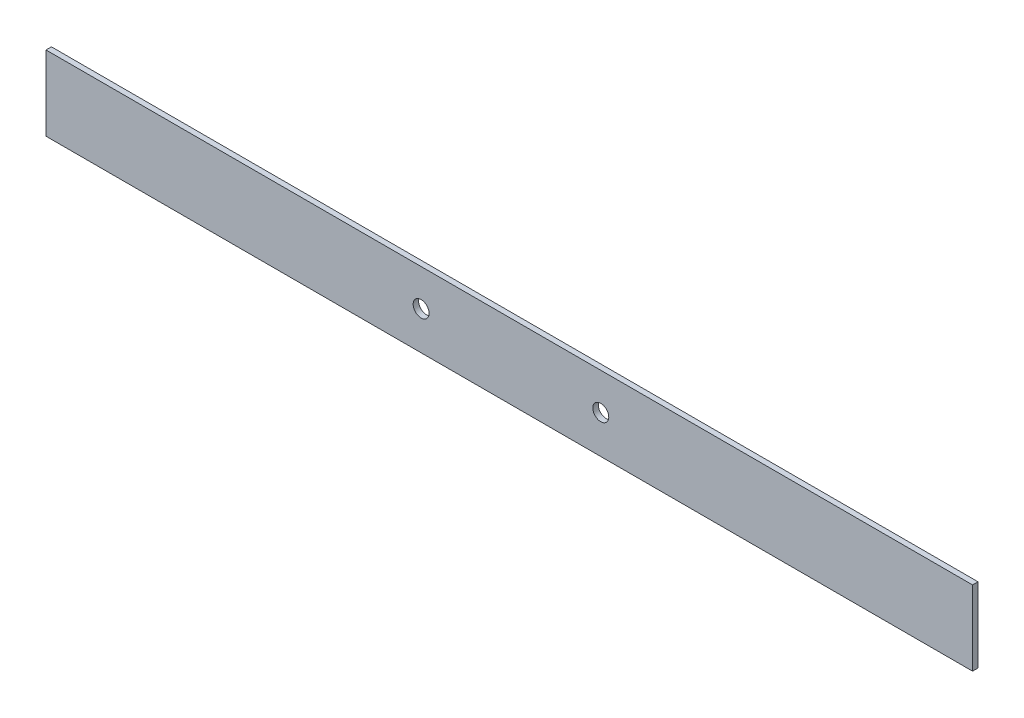
ISO-10303-21;
HEADER;
FILE_DESCRIPTION(('STEP AP214'),'2;1');
FILE_NAME('part.step','',(''),(''),'','','');
FILE_SCHEMA(('AUTOMOTIVE_DESIGN { 1 0 10303 214 1 1 1 1 }'));
ENDSEC;
DATA;
#1=APPLICATION_CONTEXT('core data for automotive mechanical design processes');
#2=APPLICATION_PROTOCOL_DEFINITION('international standard','automotive_design',2000,#1);
#3=PRODUCT_CONTEXT('',#1,'mechanical');
#4=PRODUCT('Part','Part','',(#3));
#5=PRODUCT_RELATED_PRODUCT_CATEGORY('part','',(#4));
#6=PRODUCT_DEFINITION_FORMATION('','',#4);
#7=PRODUCT_DEFINITION_CONTEXT('part definition',#1,'design');
#8=PRODUCT_DEFINITION('design','',#6,#7);
#9=PRODUCT_DEFINITION_SHAPE('','',#8);
#10=(LENGTH_UNIT() NAMED_UNIT(*) SI_UNIT(.MILLI.,.METRE.));
#11=(NAMED_UNIT(*) PLANE_ANGLE_UNIT() SI_UNIT($,.RADIAN.));
#12=(NAMED_UNIT(*) SI_UNIT($,.STERADIAN.) SOLID_ANGLE_UNIT());
#13=UNCERTAINTY_MEASURE_WITH_UNIT(LENGTH_MEASURE(1.E-05),#10,'distance_accuracy_value','');
#14=(GEOMETRIC_REPRESENTATION_CONTEXT(3) GLOBAL_UNCERTAINTY_ASSIGNED_CONTEXT((#13)) GLOBAL_UNIT_ASSIGNED_CONTEXT((#10,
#11,#12)) REPRESENTATION_CONTEXT('',''));
#15=CARTESIAN_POINT('',(0.,0.,0.));
#16=DIRECTION('',(0.,0.,1.));
#17=DIRECTION('',(1.,0.,0.));
#18=AXIS2_PLACEMENT_3D('',#15,#16,#17);
#19=CARTESIAN_POINT('',(124.,98.5,1.09144054));
#20=DIRECTION('',(0.,0.,-1.));
#21=DIRECTION('',(0.,-1.,0.));
#22=AXIS2_PLACEMENT_3D('',#19,#20,#21);
#23=PLANE('',#22);
#24=CARTESIAN_POINT('',(142.37,98.649,1.09144054));
#25=DIRECTION('',(0.,0.,1.));
#26=DIRECTION('',(1.,0.,0.));
#27=AXIS2_PLACEMENT_3D('',#24,#25,#26);
#28=CIRCLE('',#27,1.6);
#29=CARTESIAN_POINT('',(143.97,98.649,1.09144054));
#30=VERTEX_POINT('',#29);
#31=EDGE_CURVE('E20',#30,#30,#28,.T.);
#32=ORIENTED_EDGE('',*,*,#31,.F.);
#33=EDGE_LOOP('',(#32));
#34=FACE_BOUND('',#33,.T.);
#35=CARTESIAN_POINT('',(106.302,98.649,1.09144054));
#36=DIRECTION('',(0.,0.,1.));
#37=DIRECTION('',(1.,0.,0.));
#38=AXIS2_PLACEMENT_3D('',#35,#36,#37);
#39=CIRCLE('',#38,1.6);
#40=CARTESIAN_POINT('',(107.902,98.649,1.09144054));
#41=VERTEX_POINT('',#40);
#42=EDGE_CURVE('E80',#41,#41,#39,.T.);
#43=ORIENTED_EDGE('',*,*,#42,.F.);
#44=EDGE_LOOP('',(#43));
#45=FACE_BOUND('',#44,.T.);
#46=DIRECTION('',(-1.,0.,0.));
#47=VECTOR('',#46,1.);
#48=CARTESIAN_POINT('',(217.,91.,1.09144054));
#49=LINE('',#48,#47);
#50=CARTESIAN_POINT('',(217.,91.,1.09144054));
#51=VERTEX_POINT('',#50);
#52=CARTESIAN_POINT('',(31.,91.,1.09144054));
#53=VERTEX_POINT('',#52);
#54=EDGE_CURVE('E48',#51,#53,#49,.T.);
#55=ORIENTED_EDGE('',*,*,#54,.F.);
#56=DIRECTION('',(0.,-1.,0.));
#57=VECTOR('',#56,1.);
#58=CARTESIAN_POINT('',(217.,106.,1.09144054));
#59=LINE('',#58,#57);
#60=CARTESIAN_POINT('',(217.,106.,1.09144054));
#61=VERTEX_POINT('',#60);
#62=EDGE_CURVE('E114',#61,#51,#59,.T.);
#63=ORIENTED_EDGE('',*,*,#62,.F.);
#64=DIRECTION('',(1.,0.,0.));
#65=VECTOR('',#64,1.);
#66=CARTESIAN_POINT('',(31.,106.,1.09144054));
#67=LINE('',#66,#65);
#68=CARTESIAN_POINT('',(31.,106.,1.09144054));
#69=VERTEX_POINT('',#68);
#70=EDGE_CURVE('E90',#69,#61,#67,.T.);
#71=ORIENTED_EDGE('',*,*,#70,.F.);
#72=DIRECTION('',(0.,1.,0.));
#73=VECTOR('',#72,1.);
#74=CARTESIAN_POINT('',(31.,91.,1.09144054));
#75=LINE('',#74,#73);
#76=EDGE_CURVE('E94',#53,#69,#75,.T.);
#77=ORIENTED_EDGE('',*,*,#76,.F.);
#78=EDGE_LOOP('',(#55,#63,#71,#77));
#79=FACE_BOUND('',#78,.T.);
#80=ADVANCED_FACE('F17',(#34,#45,#79),#23,.F.);
#81=CARTESIAN_POINT('',(124.,98.5,0.));
#82=DIRECTION('',(0.,0.,-1.));
#83=DIRECTION('',(0.,-1.,0.));
#84=AXIS2_PLACEMENT_3D('',#81,#82,#83);
#85=PLANE('',#84);
#86=CARTESIAN_POINT('',(142.37,98.649,0.));
#87=DIRECTION('',(0.,0.,1.));
#88=DIRECTION('',(1.,0.,0.));
#89=AXIS2_PLACEMENT_3D('',#86,#87,#88);
#90=CIRCLE('',#89,1.6);
#91=CARTESIAN_POINT('',(143.97,98.649,0.));
#92=VERTEX_POINT('',#91);
#93=EDGE_CURVE('E11',#92,#92,#90,.T.);
#94=ORIENTED_EDGE('',*,*,#93,.T.);
#95=EDGE_LOOP('',(#94));
#96=FACE_BOUND('',#95,.T.);
#97=CARTESIAN_POINT('',(106.302,98.649,0.));
#98=DIRECTION('',(0.,0.,1.));
#99=DIRECTION('',(1.,0.,0.));
#100=AXIS2_PLACEMENT_3D('',#97,#98,#99);
#101=CIRCLE('',#100,1.6);
#102=CARTESIAN_POINT('',(107.902,98.649,0.));
#103=VERTEX_POINT('',#102);
#104=EDGE_CURVE('E125',#103,#103,#101,.T.);
#105=ORIENTED_EDGE('',*,*,#104,.T.);
#106=EDGE_LOOP('',(#105));
#107=FACE_BOUND('',#106,.T.);
#108=DIRECTION('',(0.,1.,0.));
#109=VECTOR('',#108,1.);
#110=CARTESIAN_POINT('',(31.,91.,0.));
#111=LINE('',#110,#109);
#112=CARTESIAN_POINT('',(31.,91.,0.));
#113=VERTEX_POINT('',#112);
#114=CARTESIAN_POINT('',(31.,106.,0.));
#115=VERTEX_POINT('',#114);
#116=EDGE_CURVE('E75',#113,#115,#111,.T.);
#117=ORIENTED_EDGE('',*,*,#116,.T.);
#118=DIRECTION('',(1.,0.,0.));
#119=VECTOR('',#118,1.);
#120=CARTESIAN_POINT('',(31.,106.,0.));
#121=LINE('',#120,#119);
#122=CARTESIAN_POINT('',(217.,106.,0.));
#123=VERTEX_POINT('',#122);
#124=EDGE_CURVE('E108',#115,#123,#121,.T.);
#125=ORIENTED_EDGE('',*,*,#124,.T.);
#126=DIRECTION('',(0.,-1.,0.));
#127=VECTOR('',#126,1.);
#128=CARTESIAN_POINT('',(217.,106.,0.));
#129=LINE('',#128,#127);
#130=CARTESIAN_POINT('',(217.,91.,0.));
#131=VERTEX_POINT('',#130);
#132=EDGE_CURVE('E77',#123,#131,#129,.T.);
#133=ORIENTED_EDGE('',*,*,#132,.T.);
#134=DIRECTION('',(-1.,0.,0.));
#135=VECTOR('',#134,1.);
#136=CARTESIAN_POINT('',(217.,91.,0.));
#137=LINE('',#136,#135);
#138=EDGE_CURVE('E38',#131,#113,#137,.T.);
#139=ORIENTED_EDGE('',*,*,#138,.T.);
#140=EDGE_LOOP('',(#117,#125,#133,#139));
#141=FACE_BOUND('',#140,.T.);
#142=ADVANCED_FACE('F73',(#96,#107,#141),#85,.T.);
#143=CARTESIAN_POINT('',(142.37,98.649,0.));
#144=DIRECTION('',(0.,0.,-1.));
#145=DIRECTION('',(1.,0.,0.));
#146=AXIS2_PLACEMENT_3D('',#143,#144,#145);
#147=CYLINDRICAL_SURFACE('',#146,1.6);
#148=ORIENTED_EDGE('',*,*,#31,.T.);
#149=EDGE_LOOP('',(#148));
#150=FACE_BOUND('',#149,.T.);
#151=ORIENTED_EDGE('',*,*,#93,.F.);
#152=EDGE_LOOP('',(#151));
#153=FACE_BOUND('',#152,.T.);
#154=ADVANCED_FACE('F143',(#150,#153),#147,.F.);
#155=CARTESIAN_POINT('',(106.302,98.649,0.));
#156=DIRECTION('',(0.,0.,-1.));
#157=DIRECTION('',(1.,0.,0.));
#158=AXIS2_PLACEMENT_3D('',#155,#156,#157);
#159=CYLINDRICAL_SURFACE('',#158,1.6);
#160=ORIENTED_EDGE('',*,*,#42,.T.);
#161=EDGE_LOOP('',(#160));
#162=FACE_BOUND('',#161,.T.);
#163=ORIENTED_EDGE('',*,*,#104,.F.);
#164=EDGE_LOOP('',(#163));
#165=FACE_BOUND('',#164,.T.);
#166=ADVANCED_FACE('F134',(#162,#165),#159,.F.);
#167=CARTESIAN_POINT('',(217.,91.,0.));
#168=DIRECTION('',(0.,-1.,0.));
#169=DIRECTION('',(0.,0.,-1.));
#170=AXIS2_PLACEMENT_3D('',#167,#168,#169);
#171=PLANE('',#170);
#172=DIRECTION('',(0.,0.,1.));
#173=VECTOR('',#172,1.);
#174=CARTESIAN_POINT('',(217.,91.,0.));
#175=LINE('',#174,#173);
#176=EDGE_CURVE('E117',#131,#51,#175,.T.);
#177=ORIENTED_EDGE('',*,*,#176,.T.);
#178=ORIENTED_EDGE('',*,*,#54,.T.);
#179=DIRECTION('',(0.,0.,1.));
#180=VECTOR('',#179,1.);
#181=CARTESIAN_POINT('',(31.,91.,0.));
#182=LINE('',#181,#180);
#183=EDGE_CURVE('E86',#113,#53,#182,.T.);
#184=ORIENTED_EDGE('',*,*,#183,.F.);
#185=ORIENTED_EDGE('',*,*,#138,.F.);
#186=EDGE_LOOP('',(#177,#178,#184,#185));
#187=FACE_BOUND('',#186,.T.);
#188=ADVANCED_FACE('F92',(#187),#171,.T.);
#189=CARTESIAN_POINT('',(217.,106.,0.));
#190=DIRECTION('',(1.,0.,0.));
#191=DIRECTION('',(0.,1.,0.));
#192=AXIS2_PLACEMENT_3D('',#189,#190,#191);
#193=PLANE('',#192);
#194=DIRECTION('',(0.,0.,1.));
#195=VECTOR('',#194,1.);
#196=CARTESIAN_POINT('',(217.,106.,0.));
#197=LINE('',#196,#195);
#198=EDGE_CURVE('E104',#123,#61,#197,.T.);
#199=ORIENTED_EDGE('',*,*,#198,.T.);
#200=ORIENTED_EDGE('',*,*,#62,.T.);
#201=ORIENTED_EDGE('',*,*,#176,.F.);
#202=ORIENTED_EDGE('',*,*,#132,.F.);
#203=EDGE_LOOP('',(#199,#200,#201,#202));
#204=FACE_BOUND('',#203,.T.);
#205=ADVANCED_FACE('F214',(#204),#193,.T.);
#206=CARTESIAN_POINT('',(31.,106.,0.));
#207=DIRECTION('',(0.,1.,0.));
#208=DIRECTION('',(1.,0.,0.));
#209=AXIS2_PLACEMENT_3D('',#206,#207,#208);
#210=PLANE('',#209);
#211=DIRECTION('',(0.,0.,1.));
#212=VECTOR('',#211,1.);
#213=CARTESIAN_POINT('',(31.,106.,0.));
#214=LINE('',#213,#212);
#215=EDGE_CURVE('E88',#115,#69,#214,.T.);
#216=ORIENTED_EDGE('',*,*,#215,.T.);
#217=ORIENTED_EDGE('',*,*,#70,.T.);
#218=ORIENTED_EDGE('',*,*,#198,.F.);
#219=ORIENTED_EDGE('',*,*,#124,.F.);
#220=EDGE_LOOP('',(#216,#217,#218,#219));
#221=FACE_BOUND('',#220,.T.);
#222=ADVANCED_FACE('F203',(#221),#210,.T.);
#223=CARTESIAN_POINT('',(31.,91.,0.));
#224=DIRECTION('',(-1.,0.,0.));
#225=DIRECTION('',(0.,0.,1.));
#226=AXIS2_PLACEMENT_3D('',#223,#224,#225);
#227=PLANE('',#226);
#228=ORIENTED_EDGE('',*,*,#183,.T.);
#229=ORIENTED_EDGE('',*,*,#76,.T.);
#230=ORIENTED_EDGE('',*,*,#215,.F.);
#231=ORIENTED_EDGE('',*,*,#116,.F.);
#232=EDGE_LOOP('',(#228,#229,#230,#231));
#233=FACE_BOUND('',#232,.T.);
#234=ADVANCED_FACE('F84',(#233),#227,.T.);
#235=CLOSED_SHELL('',(#80,#142,#154,#166,#188,#205,#222,#234));
#236=MANIFOLD_SOLID_BREP('B1',#235);
#237=ADVANCED_BREP_SHAPE_REPRESENTATION('',(#18,#236),#14);
#238=SHAPE_DEFINITION_REPRESENTATION(#9,#237);
ENDSEC;
END-ISO-10303-21;
